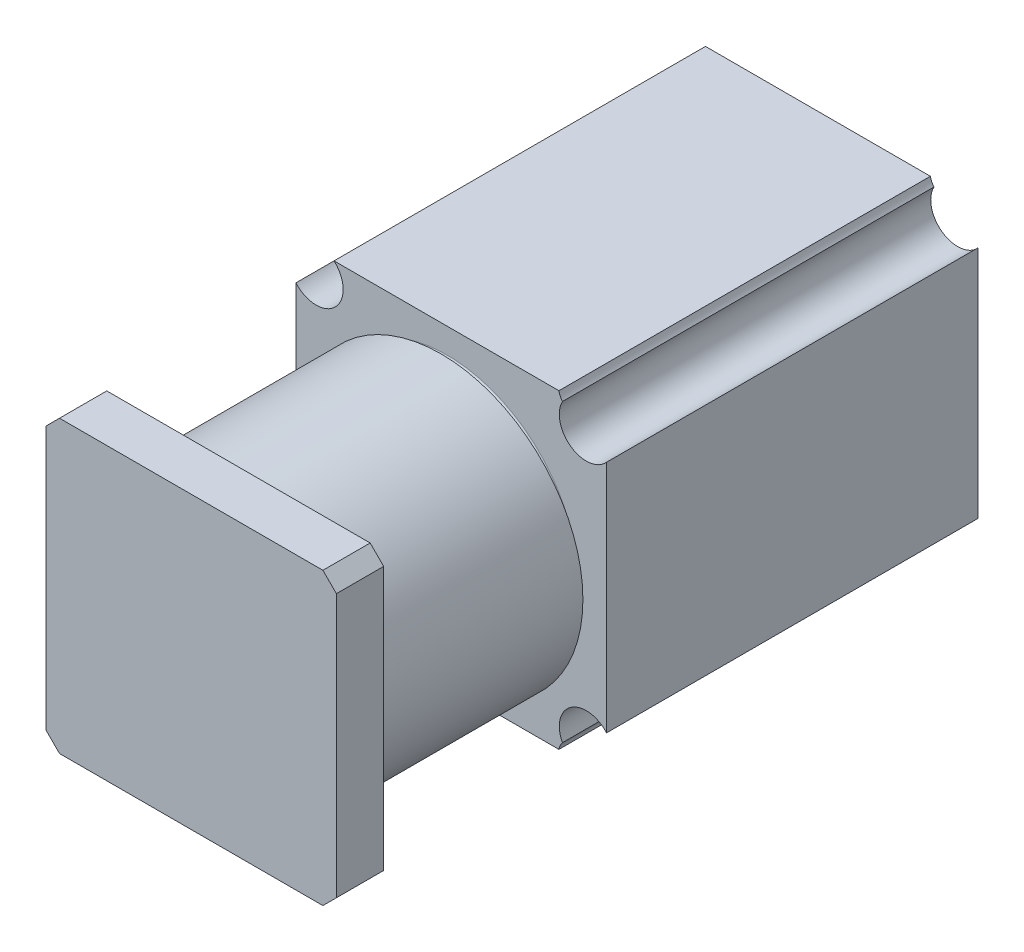
ISO-10303-21;
HEADER;
FILE_DESCRIPTION(('STEP AP214'),'2;1');
FILE_NAME('part.step','',(''),(''),'','','');
FILE_SCHEMA(('AUTOMOTIVE_DESIGN { 1 0 10303 214 1 1 1 1 }'));
ENDSEC;
DATA;
#1=APPLICATION_CONTEXT('core data for automotive mechanical design processes');
#2=APPLICATION_PROTOCOL_DEFINITION('international standard','automotive_design',2000,#1);
#3=PRODUCT_CONTEXT('',#1,'mechanical');
#4=PRODUCT('Part','Part','',(#3));
#5=PRODUCT_RELATED_PRODUCT_CATEGORY('part','',(#4));
#6=PRODUCT_DEFINITION_FORMATION('','',#4);
#7=PRODUCT_DEFINITION_CONTEXT('part definition',#1,'design');
#8=PRODUCT_DEFINITION('design','',#6,#7);
#9=PRODUCT_DEFINITION_SHAPE('','',#8);
#10=(LENGTH_UNIT() NAMED_UNIT(*) SI_UNIT(.MILLI.,.METRE.));
#11=(NAMED_UNIT(*) PLANE_ANGLE_UNIT() SI_UNIT($,.RADIAN.));
#12=(NAMED_UNIT(*) SI_UNIT($,.STERADIAN.) SOLID_ANGLE_UNIT());
#13=UNCERTAINTY_MEASURE_WITH_UNIT(LENGTH_MEASURE(1.E-05),#10,'distance_accuracy_value','');
#14=(GEOMETRIC_REPRESENTATION_CONTEXT(3) GLOBAL_UNCERTAINTY_ASSIGNED_CONTEXT((#13)) GLOBAL_UNIT_ASSIGNED_CONTEXT((#10,
#11,#12)) REPRESENTATION_CONTEXT('',''));
#15=CARTESIAN_POINT('',(0.,0.,0.));
#16=DIRECTION('',(0.,0.,1.));
#17=DIRECTION('',(1.,0.,0.));
#18=AXIS2_PLACEMENT_3D('',#15,#16,#17);
#19=CARTESIAN_POINT('',(5.49999999999999,0.,57.));
#20=DIRECTION('',(0.,0.,1.));
#21=DIRECTION('',(1.,0.,0.));
#22=AXIS2_PLACEMENT_3D('',#19,#20,#21);
#23=PLANE('',#22);
#24=CARTESIAN_POINT('',(5.49999999999999,0.,57.));
#25=DIRECTION('',(0.,0.,1.));
#26=DIRECTION('',(1.,0.,0.));
#27=AXIS2_PLACEMENT_3D('',#24,#25,#26);
#28=CIRCLE('',#27,21.);
#29=CARTESIAN_POINT('',(26.5,0.,57.));
#30=VERTEX_POINT('',#29);
#31=EDGE_CURVE('E277',#30,#30,#28,.T.);
#32=ORIENTED_EDGE('',*,*,#31,.F.);
#33=EDGE_LOOP('',(#32));
#34=FACE_BOUND('',#33,.T.);
#35=CARTESIAN_POINT('',(4.42182691890487,0.,57.));
#36=DIRECTION('',(0.,0.,1.));
#37=DIRECTION('',(1.,0.,0.));
#38=AXIS2_PLACEMENT_3D('',#35,#36,#37);
#39=CIRCLE('',#38,19.);
#40=CARTESIAN_POINT('',(23.4218269189049,0.,57.));
#41=VERTEX_POINT('',#40);
#42=EDGE_CURVE('E315',#41,#41,#39,.T.);
#43=ORIENTED_EDGE('',*,*,#42,.T.);
#44=EDGE_LOOP('',(#43));
#45=FACE_BOUND('',#44,.T.);
#46=ADVANCED_FACE('F34',(#34,#45),#23,.F.);
#47=CARTESIAN_POINT('',(5.49999999999999,0.,87.));
#48=DIRECTION('',(0.,0.,-1.));
#49=DIRECTION('',(-1.,0.,0.));
#50=AXIS2_PLACEMENT_3D('',#47,#48,#49);
#51=CYLINDRICAL_SURFACE('',#50,21.);
#52=CARTESIAN_POINT('',(5.49999999999999,0.,87.));
#53=DIRECTION('',(0.,0.,1.));
#54=DIRECTION('',(1.,0.,0.));
#55=AXIS2_PLACEMENT_3D('',#52,#53,#54);
#56=CIRCLE('',#55,21.);
#57=CARTESIAN_POINT('',(26.5,0.,87.));
#58=VERTEX_POINT('',#57);
#59=EDGE_CURVE('E273',#58,#58,#56,.T.);
#60=ORIENTED_EDGE('',*,*,#59,.F.);
#61=EDGE_LOOP('',(#60));
#62=FACE_BOUND('',#61,.T.);
#63=ORIENTED_EDGE('',*,*,#31,.T.);
#64=EDGE_LOOP('',(#63));
#65=FACE_BOUND('',#64,.T.);
#66=ADVANCED_FACE('F380',(#62,#65),#51,.T.);
#67=CARTESIAN_POINT('',(-18.,-23.,0.));
#68=DIRECTION('',(0.,0.,-1.));
#69=DIRECTION('',(-1.,0.,0.));
#70=AXIS2_PLACEMENT_3D('',#67,#68,#69);
#71=PLANE('',#70);
#72=CARTESIAN_POINT('',(23.5,23.5,0.));
#73=DIRECTION('',(0.,0.,1.));
#74=DIRECTION('',(1.,0.,0.));
#75=AXIS2_PLACEMENT_3D('',#72,#73,#74);
#76=CIRCLE('',#75,2.59999999999998);
#77=CARTESIAN_POINT('',(20.9485298355654,23.,0.));
#78=VERTEX_POINT('',#77);
#79=CARTESIAN_POINT('',(21.4681530776105,21.8777798904045,0.));
#80=VERTEX_POINT('',#79);
#81=EDGE_CURVE('E160',#78,#80,#76,.T.);
#82=ORIENTED_EDGE('',*,*,#81,.T.);
#83=CARTESIAN_POINT('',(25.,20.,0.));
#84=DIRECTION('',(0.,0.,-1.));
#85=DIRECTION('',(-1.,0.,0.));
#86=AXIS2_PLACEMENT_3D('',#83,#84,#85);
#87=CIRCLE('',#86,3.99999999999999);
#88=CARTESIAN_POINT('',(28.,17.3542486889354,0.));
#89=VERTEX_POINT('',#88);
#90=EDGE_CURVE('E206',#89,#80,#87,.T.);
#91=ORIENTED_EDGE('',*,*,#90,.F.);
#92=DIRECTION('',(0.,1.,0.));
#93=VECTOR('',#92,1.);
#94=CARTESIAN_POINT('',(28.,-23.,0.));
#95=LINE('',#94,#93);
#96=CARTESIAN_POINT('',(28.,-17.3542486889354,0.));
#97=VERTEX_POINT('',#96);
#98=EDGE_CURVE('E197',#97,#89,#95,.T.);
#99=ORIENTED_EDGE('',*,*,#98,.F.);
#100=CARTESIAN_POINT('',(25.,-20.,0.));
#101=DIRECTION('',(0.,0.,-1.));
#102=DIRECTION('',(-1.,0.,0.));
#103=AXIS2_PLACEMENT_3D('',#100,#101,#102);
#104=CIRCLE('',#103,3.99999999999999);
#105=CARTESIAN_POINT('',(21.4681530776105,-21.8777798904045,0.));
#106=VERTEX_POINT('',#105);
#107=EDGE_CURVE('E291',#106,#97,#104,.T.);
#108=ORIENTED_EDGE('',*,*,#107,.F.);
#109=CARTESIAN_POINT('',(23.5,-23.5,0.));
#110=DIRECTION('',(0.,0.,1.));
#111=DIRECTION('',(1.,0.,0.));
#112=AXIS2_PLACEMENT_3D('',#109,#110,#111);
#113=CIRCLE('',#112,2.59999999999998);
#114=CARTESIAN_POINT('',(20.9485298355654,-23.,0.));
#115=VERTEX_POINT('',#114);
#116=EDGE_CURVE('E284',#106,#115,#113,.T.);
#117=ORIENTED_EDGE('',*,*,#116,.T.);
#118=DIRECTION('',(1.,0.,0.));
#119=VECTOR('',#118,1.);
#120=CARTESIAN_POINT('',(-18.,-23.,0.));
#121=LINE('',#120,#119);
#122=CARTESIAN_POINT('',(-12.3542486889354,-23.,0.));
#123=VERTEX_POINT('',#122);
#124=EDGE_CURVE('E201',#123,#115,#121,.T.);
#125=ORIENTED_EDGE('',*,*,#124,.F.);
#126=CARTESIAN_POINT('',(-15.,-20.,0.));
#127=DIRECTION('',(0.,0.,-1.));
#128=DIRECTION('',(-1.,0.,0.));
#129=AXIS2_PLACEMENT_3D('',#126,#127,#128);
#130=CIRCLE('',#129,3.99999999999999);
#131=CARTESIAN_POINT('',(-18.,-17.3542486889354,0.));
#132=VERTEX_POINT('',#131);
#133=EDGE_CURVE('E306',#132,#123,#130,.T.);
#134=ORIENTED_EDGE('',*,*,#133,.F.);
#135=DIRECTION('',(0.,1.,0.));
#136=VECTOR('',#135,1.);
#137=CARTESIAN_POINT('',(-18.,-23.,0.));
#138=LINE('',#137,#136);
#139=CARTESIAN_POINT('',(-18.,17.3542486889354,0.));
#140=VERTEX_POINT('',#139);
#141=EDGE_CURVE('E188',#132,#140,#138,.T.);
#142=ORIENTED_EDGE('',*,*,#141,.T.);
#143=CARTESIAN_POINT('',(-15.,20.,0.));
#144=DIRECTION('',(0.,0.,-1.));
#145=DIRECTION('',(-1.,0.,0.));
#146=AXIS2_PLACEMENT_3D('',#143,#144,#145);
#147=CIRCLE('',#146,3.99999999999999);
#148=CARTESIAN_POINT('',(-12.3542486889354,23.,0.));
#149=VERTEX_POINT('',#148);
#150=EDGE_CURVE('E186',#149,#140,#147,.T.);
#151=ORIENTED_EDGE('',*,*,#150,.F.);
#152=DIRECTION('',(1.,0.,0.));
#153=VECTOR('',#152,1.);
#154=CARTESIAN_POINT('',(-18.,23.,0.));
#155=LINE('',#154,#153);
#156=EDGE_CURVE('E178',#149,#78,#155,.T.);
#157=ORIENTED_EDGE('',*,*,#156,.T.);
#158=EDGE_LOOP('',(#82,#91,#99,#108,#117,#125,#134,#142,#151,#157));
#159=FACE_BOUND('',#158,.T.);
#160=ADVANCED_FACE('F184',(#159),#71,.T.);
#161=CARTESIAN_POINT('',(28.,0.,0.));
#162=DIRECTION('',(1.,0.,0.));
#163=DIRECTION('',(0.,0.,-1.));
#164=AXIS2_PLACEMENT_3D('',#161,#162,#163);
#165=PLANE('',#164);
#166=DIRECTION('',(0.,0.,-1.));
#167=VECTOR('',#166,1.);
#168=CARTESIAN_POINT('',(28.,17.3542486889354,0.));
#169=LINE('',#168,#167);
#170=CARTESIAN_POINT('',(28.,17.3542486889354,55.));
#171=VERTEX_POINT('',#170);
#172=EDGE_CURVE('E204',#171,#89,#169,.T.);
#173=ORIENTED_EDGE('',*,*,#172,.F.);
#174=DIRECTION('',(0.,-1.,0.));
#175=VECTOR('',#174,1.);
#176=CARTESIAN_POINT('',(28.,23.,55.));
#177=LINE('',#176,#175);
#178=CARTESIAN_POINT('',(28.,-17.3542486889354,55.));
#179=VERTEX_POINT('',#178);
#180=EDGE_CURVE('E289',#171,#179,#177,.T.);
#181=ORIENTED_EDGE('',*,*,#180,.T.);
#182=DIRECTION('',(0.,0.,-1.));
#183=VECTOR('',#182,1.);
#184=CARTESIAN_POINT('',(28.,-17.3542486889354,0.));
#185=LINE('',#184,#183);
#186=EDGE_CURVE('E293',#97,#179,#185,.F.);
#187=ORIENTED_EDGE('',*,*,#186,.F.);
#188=ORIENTED_EDGE('',*,*,#98,.T.);
#189=EDGE_LOOP('',(#173,#181,#187,#188));
#190=FACE_BOUND('',#189,.T.);
#191=ADVANCED_FACE('F337',(#190),#165,.T.);
#192=CARTESIAN_POINT('',(-18.,-23.,55.));
#193=DIRECTION('',(0.,-1.,0.));
#194=DIRECTION('',(0.,0.,-1.));
#195=AXIS2_PLACEMENT_3D('',#192,#193,#194);
#196=PLANE('',#195);
#197=DIRECTION('',(0.,0.,1.));
#198=VECTOR('',#197,1.);
#199=CARTESIAN_POINT('',(20.9485298355654,-23.,55.));
#200=LINE('',#199,#198);
#201=CARTESIAN_POINT('',(20.9485298355654,-23.,55.));
#202=VERTEX_POINT('',#201);
#203=EDGE_CURVE('E287',#202,#115,#200,.F.);
#204=ORIENTED_EDGE('',*,*,#203,.F.);
#205=DIRECTION('',(1.,0.,0.));
#206=VECTOR('',#205,1.);
#207=CARTESIAN_POINT('',(-18.,-23.,55.));
#208=LINE('',#207,#206);
#209=CARTESIAN_POINT('',(-12.3542486889354,-23.,55.));
#210=VERTEX_POINT('',#209);
#211=EDGE_CURVE('E297',#210,#202,#208,.T.);
#212=ORIENTED_EDGE('',*,*,#211,.F.);
#213=DIRECTION('',(0.,0.,-1.));
#214=VECTOR('',#213,1.);
#215=CARTESIAN_POINT('',(-12.3542486889354,-23.,0.));
#216=LINE('',#215,#214);
#217=EDGE_CURVE('E312',#123,#210,#216,.F.);
#218=ORIENTED_EDGE('',*,*,#217,.F.);
#219=ORIENTED_EDGE('',*,*,#124,.T.);
#220=EDGE_LOOP('',(#204,#212,#218,#219));
#221=FACE_BOUND('',#220,.T.);
#222=ADVANCED_FACE('F356',(#221),#196,.T.);
#223=CARTESIAN_POINT('',(-18.,23.,0.));
#224=DIRECTION('',(0.,1.,0.));
#225=DIRECTION('',(0.,0.,1.));
#226=AXIS2_PLACEMENT_3D('',#223,#224,#225);
#227=PLANE('',#226);
#228=DIRECTION('',(0.,0.,1.));
#229=VECTOR('',#228,1.);
#230=CARTESIAN_POINT('',(20.9485298355654,23.,55.));
#231=LINE('',#230,#229);
#232=CARTESIAN_POINT('',(20.9485298355654,23.,55.));
#233=VERTEX_POINT('',#232);
#234=EDGE_CURVE('E163',#78,#233,#231,.T.);
#235=ORIENTED_EDGE('',*,*,#234,.F.);
#236=ORIENTED_EDGE('',*,*,#156,.F.);
#237=DIRECTION('',(0.,0.,-1.));
#238=VECTOR('',#237,1.);
#239=CARTESIAN_POINT('',(-12.3542486889354,23.,0.));
#240=LINE('',#239,#238);
#241=CARTESIAN_POINT('',(-12.3542486889354,23.,55.));
#242=VERTEX_POINT('',#241);
#243=EDGE_CURVE('E308',#242,#149,#240,.T.);
#244=ORIENTED_EDGE('',*,*,#243,.F.);
#245=DIRECTION('',(1.,0.,0.));
#246=VECTOR('',#245,1.);
#247=CARTESIAN_POINT('',(-18.,23.,55.));
#248=LINE('',#247,#246);
#249=EDGE_CURVE('E180',#242,#233,#248,.T.);
#250=ORIENTED_EDGE('',*,*,#249,.T.);
#251=EDGE_LOOP('',(#235,#236,#244,#250));
#252=FACE_BOUND('',#251,.T.);
#253=ADVANCED_FACE('F176',(#252),#227,.T.);
#254=CARTESIAN_POINT('',(-18.,0.,0.));
#255=DIRECTION('',(1.,0.,0.));
#256=DIRECTION('',(0.,0.,-1.));
#257=AXIS2_PLACEMENT_3D('',#254,#255,#256);
#258=PLANE('',#257);
#259=DIRECTION('',(0.,-1.,0.));
#260=VECTOR('',#259,1.);
#261=CARTESIAN_POINT('',(-18.,23.,55.));
#262=LINE('',#261,#260);
#263=CARTESIAN_POINT('',(-18.,17.3542486889354,55.));
#264=VERTEX_POINT('',#263);
#265=CARTESIAN_POINT('',(-18.,-17.3542486889354,55.));
#266=VERTEX_POINT('',#265);
#267=EDGE_CURVE('E300',#264,#266,#262,.T.);
#268=ORIENTED_EDGE('',*,*,#267,.F.);
#269=DIRECTION('',(0.,0.,-1.));
#270=VECTOR('',#269,1.);
#271=CARTESIAN_POINT('',(-18.,17.3542486889354,0.));
#272=LINE('',#271,#270);
#273=EDGE_CURVE('E200',#264,#140,#272,.T.);
#274=ORIENTED_EDGE('',*,*,#273,.T.);
#275=ORIENTED_EDGE('',*,*,#141,.F.);
#276=DIRECTION('',(0.,0.,-1.));
#277=VECTOR('',#276,1.);
#278=CARTESIAN_POINT('',(-18.,-17.3542486889354,0.));
#279=LINE('',#278,#277);
#280=EDGE_CURVE('E305',#132,#266,#279,.F.);
#281=ORIENTED_EDGE('',*,*,#280,.T.);
#282=EDGE_LOOP('',(#268,#274,#275,#281));
#283=FACE_BOUND('',#282,.T.);
#284=ADVANCED_FACE('F364',(#283),#258,.F.);
#285=CARTESIAN_POINT('',(-18.,23.,55.));
#286=DIRECTION('',(0.,0.,1.));
#287=DIRECTION('',(0.,-1.,0.));
#288=AXIS2_PLACEMENT_3D('',#285,#286,#287);
#289=PLANE('',#288);
#290=CARTESIAN_POINT('',(23.5,23.5,55.));
#291=DIRECTION('',(0.,0.,1.));
#292=DIRECTION('',(1.,0.,0.));
#293=AXIS2_PLACEMENT_3D('',#290,#291,#292);
#294=CIRCLE('',#293,2.59999999999998);
#295=CARTESIAN_POINT('',(21.4681530776105,21.8777798904045,55.));
#296=VERTEX_POINT('',#295);
#297=EDGE_CURVE('E171',#233,#296,#294,.T.);
#298=ORIENTED_EDGE('',*,*,#297,.F.);
#299=ORIENTED_EDGE('',*,*,#249,.F.);
#300=CARTESIAN_POINT('',(-15.,20.,55.));
#301=DIRECTION('',(0.,0.,1.));
#302=DIRECTION('',(0.,-1.,0.));
#303=AXIS2_PLACEMENT_3D('',#300,#301,#302);
#304=CIRCLE('',#303,3.99999999999999);
#305=EDGE_CURVE('E294',#264,#242,#304,.T.);
#306=ORIENTED_EDGE('',*,*,#305,.F.);
#307=ORIENTED_EDGE('',*,*,#267,.T.);
#308=CARTESIAN_POINT('',(-15.,-20.,55.));
#309=DIRECTION('',(0.,0.,1.));
#310=DIRECTION('',(0.,-1.,0.));
#311=AXIS2_PLACEMENT_3D('',#308,#309,#310);
#312=CIRCLE('',#311,3.99999999999999);
#313=EDGE_CURVE('E309',#210,#266,#312,.T.);
#314=ORIENTED_EDGE('',*,*,#313,.F.);
#315=ORIENTED_EDGE('',*,*,#211,.T.);
#316=CARTESIAN_POINT('',(23.5,-23.5,55.));
#317=DIRECTION('',(0.,0.,1.));
#318=DIRECTION('',(1.,0.,0.));
#319=AXIS2_PLACEMENT_3D('',#316,#317,#318);
#320=CIRCLE('',#319,2.59999999999998);
#321=CARTESIAN_POINT('',(21.4681530776105,-21.8777798904045,55.));
#322=VERTEX_POINT('',#321);
#323=EDGE_CURVE('E181',#322,#202,#320,.T.);
#324=ORIENTED_EDGE('',*,*,#323,.F.);
#325=CARTESIAN_POINT('',(25.,-20.,55.));
#326=DIRECTION('',(0.,0.,1.));
#327=DIRECTION('',(0.,-1.,0.));
#328=AXIS2_PLACEMENT_3D('',#325,#326,#327);
#329=CIRCLE('',#328,3.99999999999999);
#330=EDGE_CURVE('E205',#179,#322,#329,.T.);
#331=ORIENTED_EDGE('',*,*,#330,.F.);
#332=ORIENTED_EDGE('',*,*,#180,.F.);
#333=CARTESIAN_POINT('',(25.,20.,55.));
#334=DIRECTION('',(0.,0.,1.));
#335=DIRECTION('',(0.,-1.,0.));
#336=AXIS2_PLACEMENT_3D('',#333,#334,#335);
#337=CIRCLE('',#336,3.99999999999999);
#338=EDGE_CURVE('E202',#296,#171,#337,.T.);
#339=ORIENTED_EDGE('',*,*,#338,.F.);
#340=EDGE_LOOP('',(#298,#299,#306,#307,#314,#315,#324,#331,#332,#339));
#341=FACE_BOUND('',#340,.T.);
#342=CARTESIAN_POINT('',(4.42182691890487,0.,55.));
#343=DIRECTION('',(0.,0.,1.));
#344=DIRECTION('',(0.,-1.,0.));
#345=AXIS2_PLACEMENT_3D('',#342,#343,#344);
#346=CIRCLE('',#345,19.3);
#347=CARTESIAN_POINT('',(4.42182691890487,-19.3,55.));
#348=VERTEX_POINT('',#347);
#349=EDGE_CURVE('E193',#348,#348,#346,.F.);
#350=ORIENTED_EDGE('',*,*,#349,.T.);
#351=EDGE_LOOP('',(#350));
#352=FACE_BOUND('',#351,.T.);
#353=ADVANCED_FACE('F343',(#341,#352),#289,.T.);
#354=CARTESIAN_POINT('',(4.42182691890487,0.,57.));
#355=DIRECTION('',(0.,0.,-1.));
#356=DIRECTION('',(-1.,0.,0.));
#357=AXIS2_PLACEMENT_3D('',#354,#355,#356);
#358=CYLINDRICAL_SURFACE('',#357,19.);
#359=CARTESIAN_POINT('',(4.42182691890487,0.,55.3));
#360=DIRECTION('',(0.,0.,1.));
#361=DIRECTION('',(0.,-1.,0.));
#362=AXIS2_PLACEMENT_3D('',#359,#360,#361);
#363=CIRCLE('',#362,19.);
#364=CARTESIAN_POINT('',(4.42182691890487,-19.,55.3));
#365=VERTEX_POINT('',#364);
#366=EDGE_CURVE('E191',#365,#365,#363,.T.);
#367=ORIENTED_EDGE('',*,*,#366,.T.);
#368=EDGE_LOOP('',(#367));
#369=FACE_BOUND('',#368,.T.);
#370=ORIENTED_EDGE('',*,*,#42,.F.);
#371=EDGE_LOOP('',(#370));
#372=FACE_BOUND('',#371,.T.);
#373=ADVANCED_FACE('F419',(#369,#372),#358,.T.);
#374=CARTESIAN_POINT('',(4.42182691890487,0.,55.3));
#375=DIRECTION('',(0.,0.,1.));
#376=DIRECTION('',(0.,-1.,0.));
#377=AXIS2_PLACEMENT_3D('',#374,#375,#376);
#378=TOROIDAL_SURFACE('',#377,19.3,0.299999999999998);
#379=ORIENTED_EDGE('',*,*,#349,.F.);
#380=EDGE_LOOP('',(#379));
#381=FACE_BOUND('',#380,.T.);
#382=ORIENTED_EDGE('',*,*,#366,.F.);
#383=EDGE_LOOP('',(#382));
#384=FACE_BOUND('',#383,.T.);
#385=ADVANCED_FACE('F375',(#381,#384),#378,.F.);
#386=CARTESIAN_POINT('',(-15.,-20.,0.));
#387=DIRECTION('',(0.,0.,-1.));
#388=DIRECTION('',(-1.,0.,0.));
#389=AXIS2_PLACEMENT_3D('',#386,#387,#388);
#390=CYLINDRICAL_SURFACE('',#389,3.99999999999999);
#391=ORIENTED_EDGE('',*,*,#217,.T.);
#392=ORIENTED_EDGE('',*,*,#313,.T.);
#393=ORIENTED_EDGE('',*,*,#280,.F.);
#394=ORIENTED_EDGE('',*,*,#133,.T.);
#395=EDGE_LOOP('',(#391,#392,#393,#394));
#396=FACE_BOUND('',#395,.T.);
#397=ADVANCED_FACE('F360',(#396),#390,.F.);
#398=CARTESIAN_POINT('',(-15.,20.,0.));
#399=DIRECTION('',(0.,0.,-1.));
#400=DIRECTION('',(-1.,0.,0.));
#401=AXIS2_PLACEMENT_3D('',#398,#399,#400);
#402=CYLINDRICAL_SURFACE('',#401,3.99999999999999);
#403=ORIENTED_EDGE('',*,*,#243,.T.);
#404=ORIENTED_EDGE('',*,*,#150,.T.);
#405=ORIENTED_EDGE('',*,*,#273,.F.);
#406=ORIENTED_EDGE('',*,*,#305,.T.);
#407=EDGE_LOOP('',(#403,#404,#405,#406));
#408=FACE_BOUND('',#407,.T.);
#409=ADVANCED_FACE('F367',(#408),#402,.F.);
#410=CARTESIAN_POINT('',(25.,-20.,0.));
#411=DIRECTION('',(0.,0.,-1.));
#412=DIRECTION('',(-1.,0.,0.));
#413=AXIS2_PLACEMENT_3D('',#410,#411,#412);
#414=CYLINDRICAL_SURFACE('',#413,3.99999999999999);
#415=ORIENTED_EDGE('',*,*,#330,.T.);
#416=DIRECTION('',(0.,0.,1.));
#417=VECTOR('',#416,1.);
#418=CARTESIAN_POINT('',(21.4681530776105,-21.8777798904045,27.5));
#419=LINE('',#418,#417);
#420=EDGE_CURVE('E208',#322,#106,#419,.F.);
#421=ORIENTED_EDGE('',*,*,#420,.T.);
#422=ORIENTED_EDGE('',*,*,#107,.T.);
#423=ORIENTED_EDGE('',*,*,#186,.T.);
#424=EDGE_LOOP('',(#415,#421,#422,#423));
#425=FACE_BOUND('',#424,.T.);
#426=ADVANCED_FACE('F348',(#425),#414,.F.);
#427=CARTESIAN_POINT('',(25.,20.,0.));
#428=DIRECTION('',(0.,0.,-1.));
#429=DIRECTION('',(-1.,0.,0.));
#430=AXIS2_PLACEMENT_3D('',#427,#428,#429);
#431=CYLINDRICAL_SURFACE('',#430,3.99999999999999);
#432=ORIENTED_EDGE('',*,*,#90,.T.);
#433=DIRECTION('',(0.,0.,1.));
#434=VECTOR('',#433,1.);
#435=CARTESIAN_POINT('',(21.4681530776105,21.8777798904045,27.5));
#436=LINE('',#435,#434);
#437=EDGE_CURVE('E166',#80,#296,#436,.T.);
#438=ORIENTED_EDGE('',*,*,#437,.T.);
#439=ORIENTED_EDGE('',*,*,#338,.T.);
#440=ORIENTED_EDGE('',*,*,#172,.T.);
#441=EDGE_LOOP('',(#432,#438,#439,#440));
#442=FACE_BOUND('',#441,.T.);
#443=ADVANCED_FACE('F340',(#442),#431,.F.);
#444=CARTESIAN_POINT('',(23.5,-23.5,55.));
#445=DIRECTION('',(0.,0.,1.));
#446=DIRECTION('',(1.,0.,0.));
#447=AXIS2_PLACEMENT_3D('',#444,#445,#446);
#448=CYLINDRICAL_SURFACE('',#447,2.59999999999998);
#449=ORIENTED_EDGE('',*,*,#203,.T.);
#450=ORIENTED_EDGE('',*,*,#116,.F.);
#451=ORIENTED_EDGE('',*,*,#420,.F.);
#452=ORIENTED_EDGE('',*,*,#323,.T.);
#453=EDGE_LOOP('',(#449,#450,#451,#452));
#454=FACE_BOUND('',#453,.T.);
#455=ADVANCED_FACE('F350',(#454),#448,.F.);
#456=CARTESIAN_POINT('',(23.5,23.5,55.));
#457=DIRECTION('',(0.,0.,1.));
#458=DIRECTION('',(1.,0.,0.));
#459=AXIS2_PLACEMENT_3D('',#456,#457,#458);
#460=CYLINDRICAL_SURFACE('',#459,2.59999999999998);
#461=ORIENTED_EDGE('',*,*,#234,.T.);
#462=ORIENTED_EDGE('',*,*,#297,.T.);
#463=ORIENTED_EDGE('',*,*,#437,.F.);
#464=ORIENTED_EDGE('',*,*,#81,.F.);
#465=EDGE_LOOP('',(#461,#462,#463,#464));
#466=FACE_BOUND('',#465,.T.);
#467=ADVANCED_FACE('F162',(#466),#460,.F.);
#468=CARTESIAN_POINT('',(0.,0.,87.));
#469=DIRECTION('',(0.,0.,1.));
#470=DIRECTION('',(1.,0.,0.));
#471=AXIS2_PLACEMENT_3D('',#468,#469,#470);
#472=PLANE('',#471);
#473=DIRECTION('',(1.,0.,0.));
#474=VECTOR('',#473,1.);
#475=CARTESIAN_POINT('',(-16.,-21.5,87.));
#476=LINE('',#475,#474);
#477=CARTESIAN_POINT('',(-14.,-21.5,87.));
#478=VERTEX_POINT('',#477);
#479=CARTESIAN_POINT('',(25.,-21.5,87.));
#480=VERTEX_POINT('',#479);
#481=EDGE_CURVE('E271',#478,#480,#476,.T.);
#482=ORIENTED_EDGE('',*,*,#481,.F.);
#483=DIRECTION('',(0.707106781186545,-0.70710678118655,0.));
#484=VECTOR('',#483,1.);
#485=CARTESIAN_POINT('',(-14.,-21.5,87.));
#486=LINE('',#485,#484);
#487=CARTESIAN_POINT('',(-16.,-19.5,87.));
#488=VERTEX_POINT('',#487);
#489=EDGE_CURVE('E226',#478,#488,#486,.F.);
#490=ORIENTED_EDGE('',*,*,#489,.T.);
#491=DIRECTION('',(0.,-1.,0.));
#492=VECTOR('',#491,1.);
#493=CARTESIAN_POINT('',(-16.,21.5,87.));
#494=LINE('',#493,#492);
#495=CARTESIAN_POINT('',(-16.,19.5,87.));
#496=VERTEX_POINT('',#495);
#497=EDGE_CURVE('E263',#496,#488,#494,.T.);
#498=ORIENTED_EDGE('',*,*,#497,.F.);
#499=DIRECTION('',(-0.70710678118655,-0.707106781186545,0.));
#500=VECTOR('',#499,1.);
#501=CARTESIAN_POINT('',(-16.,19.5,87.));
#502=LINE('',#501,#500);
#503=CARTESIAN_POINT('',(-14.,21.5,87.));
#504=VERTEX_POINT('',#503);
#505=EDGE_CURVE('E220',#496,#504,#502,.F.);
#506=ORIENTED_EDGE('',*,*,#505,.T.);
#507=DIRECTION('',(-1.,0.,0.));
#508=VECTOR('',#507,1.);
#509=CARTESIAN_POINT('',(-16.,21.5,87.));
#510=LINE('',#509,#508);
#511=CARTESIAN_POINT('',(25.,21.5,87.));
#512=VERTEX_POINT('',#511);
#513=EDGE_CURVE('E261',#512,#504,#510,.T.);
#514=ORIENTED_EDGE('',*,*,#513,.F.);
#515=DIRECTION('',(-0.707106781186545,0.70710678118655,0.));
#516=VECTOR('',#515,1.);
#517=CARTESIAN_POINT('',(25.,21.5,87.));
#518=LINE('',#517,#516);
#519=CARTESIAN_POINT('',(27.,19.5,87.));
#520=VERTEX_POINT('',#519);
#521=EDGE_CURVE('E222',#512,#520,#518,.F.);
#522=ORIENTED_EDGE('',*,*,#521,.T.);
#523=DIRECTION('',(0.,1.,0.));
#524=VECTOR('',#523,1.);
#525=CARTESIAN_POINT('',(27.,21.5,87.));
#526=LINE('',#525,#524);
#527=CARTESIAN_POINT('',(27.,-19.5,87.));
#528=VERTEX_POINT('',#527);
#529=EDGE_CURVE('E250',#528,#520,#526,.T.);
#530=ORIENTED_EDGE('',*,*,#529,.F.);
#531=DIRECTION('',(0.70710678118655,0.707106781186545,0.));
#532=VECTOR('',#531,1.);
#533=CARTESIAN_POINT('',(27.,-19.5,87.));
#534=LINE('',#533,#532);
#535=EDGE_CURVE('E224',#528,#480,#534,.F.);
#536=ORIENTED_EDGE('',*,*,#535,.T.);
#537=EDGE_LOOP('',(#482,#490,#498,#506,#514,#522,#530,#536));
#538=FACE_BOUND('',#537,.T.);
#539=ORIENTED_EDGE('',*,*,#59,.T.);
#540=EDGE_LOOP('',(#539));
#541=FACE_BOUND('',#540,.T.);
#542=ADVANCED_FACE('F257',(#538,#541),#472,.F.);
#543=CARTESIAN_POINT('',(27.,21.5,94.));
#544=DIRECTION('',(-1.,0.,0.));
#545=DIRECTION('',(0.,-1.,0.));
#546=AXIS2_PLACEMENT_3D('',#543,#544,#545);
#547=PLANE('',#546);
#548=DIRECTION('',(0.,1.,0.));
#549=VECTOR('',#548,1.);
#550=CARTESIAN_POINT('',(27.,21.5,94.));
#551=LINE('',#550,#549);
#552=CARTESIAN_POINT('',(27.,-19.5,94.));
#553=VERTEX_POINT('',#552);
#554=CARTESIAN_POINT('',(27.,19.5,94.));
#555=VERTEX_POINT('',#554);
#556=EDGE_CURVE('E252',#553,#555,#551,.T.);
#557=ORIENTED_EDGE('',*,*,#556,.F.);
#558=DIRECTION('',(0.,0.,-1.));
#559=VECTOR('',#558,1.);
#560=CARTESIAN_POINT('',(27.,-19.5,94.));
#561=LINE('',#560,#559);
#562=EDGE_CURVE('E242',#553,#528,#561,.T.);
#563=ORIENTED_EDGE('',*,*,#562,.T.);
#564=ORIENTED_EDGE('',*,*,#529,.T.);
#565=DIRECTION('',(0.,0.,1.));
#566=VECTOR('',#565,1.);
#567=CARTESIAN_POINT('',(27.,19.5,94.));
#568=LINE('',#567,#566);
#569=EDGE_CURVE('E240',#520,#555,#568,.T.);
#570=ORIENTED_EDGE('',*,*,#569,.T.);
#571=EDGE_LOOP('',(#557,#563,#564,#570));
#572=FACE_BOUND('',#571,.T.);
#573=ADVANCED_FACE('F249',(#572),#547,.F.);
#574=CARTESIAN_POINT('',(-16.,21.5,94.));
#575=DIRECTION('',(0.,-1.,0.));
#576=DIRECTION('',(0.,0.,-1.));
#577=AXIS2_PLACEMENT_3D('',#574,#575,#576);
#578=PLANE('',#577);
#579=DIRECTION('',(-1.,0.,0.));
#580=VECTOR('',#579,1.);
#581=CARTESIAN_POINT('',(-16.,21.5,94.));
#582=LINE('',#581,#580);
#583=CARTESIAN_POINT('',(25.,21.5,94.));
#584=VERTEX_POINT('',#583);
#585=CARTESIAN_POINT('',(-14.,21.5,94.));
#586=VERTEX_POINT('',#585);
#587=EDGE_CURVE('E454',#584,#586,#582,.T.);
#588=ORIENTED_EDGE('',*,*,#587,.F.);
#589=DIRECTION('',(0.,0.,-1.));
#590=VECTOR('',#589,1.);
#591=CARTESIAN_POINT('',(25.,21.5,94.));
#592=LINE('',#591,#590);
#593=EDGE_CURVE('E11',#584,#512,#592,.T.);
#594=ORIENTED_EDGE('',*,*,#593,.T.);
#595=ORIENTED_EDGE('',*,*,#513,.T.);
#596=DIRECTION('',(0.,0.,1.));
#597=VECTOR('',#596,1.);
#598=CARTESIAN_POINT('',(-14.,21.5,94.));
#599=LINE('',#598,#597);
#600=EDGE_CURVE('E43',#504,#586,#599,.T.);
#601=ORIENTED_EDGE('',*,*,#600,.T.);
#602=EDGE_LOOP('',(#588,#594,#595,#601));
#603=FACE_BOUND('',#602,.T.);
#604=ADVANCED_FACE('F453',(#603),#578,.F.);
#605=CARTESIAN_POINT('',(-16.,21.5,94.));
#606=DIRECTION('',(1.,0.,0.));
#607=DIRECTION('',(0.,1.,0.));
#608=AXIS2_PLACEMENT_3D('',#605,#606,#607);
#609=PLANE('',#608);
#610=ORIENTED_EDGE('',*,*,#497,.T.);
#611=DIRECTION('',(0.,0.,1.));
#612=VECTOR('',#611,1.);
#613=CARTESIAN_POINT('',(-16.,-19.5,94.));
#614=LINE('',#613,#612);
#615=CARTESIAN_POINT('',(-16.,-19.5,94.));
#616=VERTEX_POINT('',#615);
#617=EDGE_CURVE('E231',#488,#616,#614,.T.);
#618=ORIENTED_EDGE('',*,*,#617,.T.);
#619=DIRECTION('',(0.,-1.,0.));
#620=VECTOR('',#619,1.);
#621=CARTESIAN_POINT('',(-16.,21.5,94.));
#622=LINE('',#621,#620);
#623=CARTESIAN_POINT('',(-16.,19.5,94.));
#624=VERTEX_POINT('',#623);
#625=EDGE_CURVE('E463',#624,#616,#622,.T.);
#626=ORIENTED_EDGE('',*,*,#625,.F.);
#627=DIRECTION('',(0.,0.,-1.));
#628=VECTOR('',#627,1.);
#629=CARTESIAN_POINT('',(-16.,19.5,94.));
#630=LINE('',#629,#628);
#631=EDGE_CURVE('E228',#624,#496,#630,.T.);
#632=ORIENTED_EDGE('',*,*,#631,.T.);
#633=EDGE_LOOP('',(#610,#618,#626,#632));
#634=FACE_BOUND('',#633,.T.);
#635=ADVANCED_FACE('F460',(#634),#609,.F.);
#636=CARTESIAN_POINT('',(-16.,-21.5,94.));
#637=DIRECTION('',(0.,1.,0.));
#638=DIRECTION('',(0.,0.,1.));
#639=AXIS2_PLACEMENT_3D('',#636,#637,#638);
#640=PLANE('',#639);
#641=DIRECTION('',(1.,0.,0.));
#642=VECTOR('',#641,1.);
#643=CARTESIAN_POINT('',(-16.,-21.5,94.));
#644=LINE('',#643,#642);
#645=CARTESIAN_POINT('',(-14.,-21.5,94.));
#646=VERTEX_POINT('',#645);
#647=CARTESIAN_POINT('',(25.,-21.5,94.));
#648=VERTEX_POINT('',#647);
#649=EDGE_CURVE('E266',#646,#648,#644,.T.);
#650=ORIENTED_EDGE('',*,*,#649,.F.);
#651=DIRECTION('',(0.,0.,-1.));
#652=VECTOR('',#651,1.);
#653=CARTESIAN_POINT('',(-14.,-21.5,94.));
#654=LINE('',#653,#652);
#655=EDGE_CURVE('E217',#646,#478,#654,.T.);
#656=ORIENTED_EDGE('',*,*,#655,.T.);
#657=ORIENTED_EDGE('',*,*,#481,.T.);
#658=DIRECTION('',(0.,0.,1.));
#659=VECTOR('',#658,1.);
#660=CARTESIAN_POINT('',(25.,-21.5,94.));
#661=LINE('',#660,#659);
#662=EDGE_CURVE('E215',#480,#648,#661,.T.);
#663=ORIENTED_EDGE('',*,*,#662,.T.);
#664=EDGE_LOOP('',(#650,#656,#657,#663));
#665=FACE_BOUND('',#664,.T.);
#666=ADVANCED_FACE('F471',(#665),#640,.F.);
#667=CARTESIAN_POINT('',(0.,0.,94.));
#668=DIRECTION('',(0.,0.,1.));
#669=DIRECTION('',(1.,0.,0.));
#670=AXIS2_PLACEMENT_3D('',#667,#668,#669);
#671=PLANE('',#670);
#672=ORIENTED_EDGE('',*,*,#625,.T.);
#673=DIRECTION('',(-0.707106781186545,0.70710678118655,0.));
#674=VECTOR('',#673,1.);
#675=CARTESIAN_POINT('',(-17.75,-17.7499999999999,94.));
#676=LINE('',#675,#674);
#677=EDGE_CURVE('E238',#616,#646,#676,.F.);
#678=ORIENTED_EDGE('',*,*,#677,.T.);
#679=ORIENTED_EDGE('',*,*,#649,.T.);
#680=DIRECTION('',(-0.70710678118655,-0.707106781186545,0.));
#681=VECTOR('',#680,1.);
#682=CARTESIAN_POINT('',(23.2499999999999,-23.2500000000001,94.));
#683=LINE('',#682,#681);
#684=EDGE_CURVE('E236',#648,#553,#683,.F.);
#685=ORIENTED_EDGE('',*,*,#684,.T.);
#686=ORIENTED_EDGE('',*,*,#556,.T.);
#687=DIRECTION('',(0.707106781186545,-0.70710678118655,0.));
#688=VECTOR('',#687,1.);
#689=CARTESIAN_POINT('',(23.2500000000001,23.2499999999999,94.));
#690=LINE('',#689,#688);
#691=EDGE_CURVE('E56',#555,#584,#690,.F.);
#692=ORIENTED_EDGE('',*,*,#691,.T.);
#693=ORIENTED_EDGE('',*,*,#587,.T.);
#694=DIRECTION('',(0.70710678118655,0.707106781186545,0.));
#695=VECTOR('',#694,1.);
#696=CARTESIAN_POINT('',(-17.7499999999999,17.7500000000001,94.));
#697=LINE('',#696,#695);
#698=EDGE_CURVE('E233',#586,#624,#697,.F.);
#699=ORIENTED_EDGE('',*,*,#698,.T.);
#700=EDGE_LOOP('',(#672,#678,#679,#685,#686,#692,#693,#699));
#701=FACE_BOUND('',#700,.T.);
#702=ADVANCED_FACE('F443',(#701),#671,.T.);
#703=CARTESIAN_POINT('',(-14.,-21.5,94.));
#704=DIRECTION('',(0.70710678118655,0.707106781186545,0.));
#705=DIRECTION('',(0.,0.,-1.));
#706=AXIS2_PLACEMENT_3D('',#703,#704,#705);
#707=PLANE('',#706);
#708=ORIENTED_EDGE('',*,*,#677,.F.);
#709=ORIENTED_EDGE('',*,*,#617,.F.);
#710=ORIENTED_EDGE('',*,*,#489,.F.);
#711=ORIENTED_EDGE('',*,*,#655,.F.);
#712=EDGE_LOOP('',(#708,#709,#710,#711));
#713=FACE_BOUND('',#712,.T.);
#714=ADVANCED_FACE('F439',(#713),#707,.F.);
#715=CARTESIAN_POINT('',(27.,-19.5,94.));
#716=DIRECTION('',(-0.707106781186545,0.70710678118655,0.));
#717=DIRECTION('',(0.,0.,-1.));
#718=AXIS2_PLACEMENT_3D('',#715,#716,#717);
#719=PLANE('',#718);
#720=ORIENTED_EDGE('',*,*,#684,.F.);
#721=ORIENTED_EDGE('',*,*,#662,.F.);
#722=ORIENTED_EDGE('',*,*,#535,.F.);
#723=ORIENTED_EDGE('',*,*,#562,.F.);
#724=EDGE_LOOP('',(#720,#721,#722,#723));
#725=FACE_BOUND('',#724,.T.);
#726=ADVANCED_FACE('F442',(#725),#719,.F.);
#727=CARTESIAN_POINT('',(25.,21.5,94.));
#728=DIRECTION('',(-0.70710678118655,-0.707106781186545,0.));
#729=DIRECTION('',(0.,0.,-1.));
#730=AXIS2_PLACEMENT_3D('',#727,#728,#729);
#731=PLANE('',#730);
#732=ORIENTED_EDGE('',*,*,#691,.F.);
#733=ORIENTED_EDGE('',*,*,#569,.F.);
#734=ORIENTED_EDGE('',*,*,#521,.F.);
#735=ORIENTED_EDGE('',*,*,#593,.F.);
#736=EDGE_LOOP('',(#732,#733,#734,#735));
#737=FACE_BOUND('',#736,.T.);
#738=ADVANCED_FACE('F446',(#737),#731,.F.);
#739=CARTESIAN_POINT('',(-16.,19.5,94.));
#740=DIRECTION('',(0.707106781186545,-0.70710678118655,0.));
#741=DIRECTION('',(0.,0.,-1.));
#742=AXIS2_PLACEMENT_3D('',#739,#740,#741);
#743=PLANE('',#742);
#744=ORIENTED_EDGE('',*,*,#698,.F.);
#745=ORIENTED_EDGE('',*,*,#600,.F.);
#746=ORIENTED_EDGE('',*,*,#505,.F.);
#747=ORIENTED_EDGE('',*,*,#631,.F.);
#748=EDGE_LOOP('',(#744,#745,#746,#747));
#749=FACE_BOUND('',#748,.T.);
#750=ADVANCED_FACE('F36',(#749),#743,.F.);
#751=CLOSED_SHELL('',(#46,#66,#160,#191,#222,#253,#284,#353,#373,#385,#397,#409,#426,#443,#455,
#467,#542,#573,#604,#635,#666,#702,#714,#726,#738,#750));
#752=CARTESIAN_POINT('',(0.,0.,57.));
#753=DIRECTION('',(0.,0.,1.));
#754=DIRECTION('',(1.,0.,0.));
#755=AXIS2_PLACEMENT_3D('',#752,#753,#754);
#756=CIRCLE('',#755,3.175);
#757=CARTESIAN_POINT('',(3.175,0.,57.));
#758=VERTEX_POINT('',#757);
#759=EDGE_CURVE('E212',#758,#758,#756,.T.);
#760=ORIENTED_EDGE('',*,*,#759,.T.);
#761=EDGE_LOOP('',(#760));
#762=FACE_BOUND('',#761,.T.);
#763=CARTESIAN_POINT('',(0.,0.,57.));
#764=DIRECTION('',(0.,0.,1.));
#765=DIRECTION('',(1.,0.,0.));
#766=AXIS2_PLACEMENT_3D('',#763,#764,#765);
#767=CIRCLE('',#766,5.49999999999999);
#768=CARTESIAN_POINT('',(5.49999999999999,0.,57.));
#769=VERTEX_POINT('',#768);
#770=EDGE_CURVE('E276',#769,#769,#767,.F.);
#771=ORIENTED_EDGE('',*,*,#770,.T.);
#772=EDGE_LOOP('',(#771));
#773=FACE_BOUND('',#772,.T.);
#774=ADVANCED_FACE('F383',(#762,#773),#23,.F.);
#775=CARTESIAN_POINT('',(0.,0.,57.));
#776=DIRECTION('',(0.,0.,1.));
#777=DIRECTION('',(1.,0.,0.));
#778=AXIS2_PLACEMENT_3D('',#775,#776,#777);
#779=CYLINDRICAL_SURFACE('',#778,5.49999999999999);
#780=CARTESIAN_POINT('',(0.,0.,55.));
#781=DIRECTION('',(0.,0.,1.));
#782=DIRECTION('',(1.,0.,0.));
#783=AXIS2_PLACEMENT_3D('',#780,#781,#782);
#784=CIRCLE('',#783,5.49999999999999);
#785=CARTESIAN_POINT('',(5.49999999999999,0.,55.));
#786=VERTEX_POINT('',#785);
#787=EDGE_CURVE('E187',#786,#786,#784,.T.);
#788=ORIENTED_EDGE('',*,*,#787,.F.);
#789=EDGE_LOOP('',(#788));
#790=FACE_BOUND('',#789,.T.);
#791=ORIENTED_EDGE('',*,*,#770,.F.);
#792=EDGE_LOOP('',(#791));
#793=FACE_BOUND('',#792,.T.);
#794=ADVANCED_FACE('F393',(#790,#793),#779,.F.);
#795=CARTESIAN_POINT('',(0.,0.,55.));
#796=DIRECTION('',(0.,0.,-1.));
#797=DIRECTION('',(-1.,0.,0.));
#798=AXIS2_PLACEMENT_3D('',#795,#796,#797);
#799=PLANE('',#798);
#800=ORIENTED_EDGE('',*,*,#787,.T.);
#801=EDGE_LOOP('',(#800));
#802=FACE_BOUND('',#801,.T.);
#803=CARTESIAN_POINT('',(0.,0.,55.));
#804=DIRECTION('',(0.,0.,-1.));
#805=DIRECTION('',(-1.,0.,0.));
#806=AXIS2_PLACEMENT_3D('',#803,#804,#805);
#807=CIRCLE('',#806,3.175);
#808=CARTESIAN_POINT('',(-3.175,0.,55.));
#809=VERTEX_POINT('',#808);
#810=EDGE_CURVE('E313',#809,#809,#807,.F.);
#811=ORIENTED_EDGE('',*,*,#810,.F.);
#812=EDGE_LOOP('',(#811));
#813=FACE_BOUND('',#812,.T.);
#814=ADVANCED_FACE('F400',(#802,#813),#799,.F.);
#815=CARTESIAN_POINT('',(0.,0.,76.));
#816=DIRECTION('',(0.,0.,-1.));
#817=DIRECTION('',(-1.,0.,0.));
#818=AXIS2_PLACEMENT_3D('',#815,#816,#817);
#819=CYLINDRICAL_SURFACE('',#818,3.175);
#820=ORIENTED_EDGE('',*,*,#810,.T.);
#821=EDGE_LOOP('',(#820));
#822=FACE_BOUND('',#821,.T.);
#823=ORIENTED_EDGE('',*,*,#759,.F.);
#824=EDGE_LOOP('',(#823));
#825=FACE_BOUND('',#824,.T.);
#826=ADVANCED_FACE('F408',(#822,#825),#819,.T.);
#827=CLOSED_SHELL('',(#774,#794,#814,#826));
#828=ORIENTED_CLOSED_SHELL('',*,#827,.T.);
#829=BREP_WITH_VOIDS('B2',#751,(#828));
#830=ADVANCED_BREP_SHAPE_REPRESENTATION('',(#18,#829),#14);
#831=SHAPE_DEFINITION_REPRESENTATION(#9,#830);
ENDSEC;
END-ISO-10303-21;
